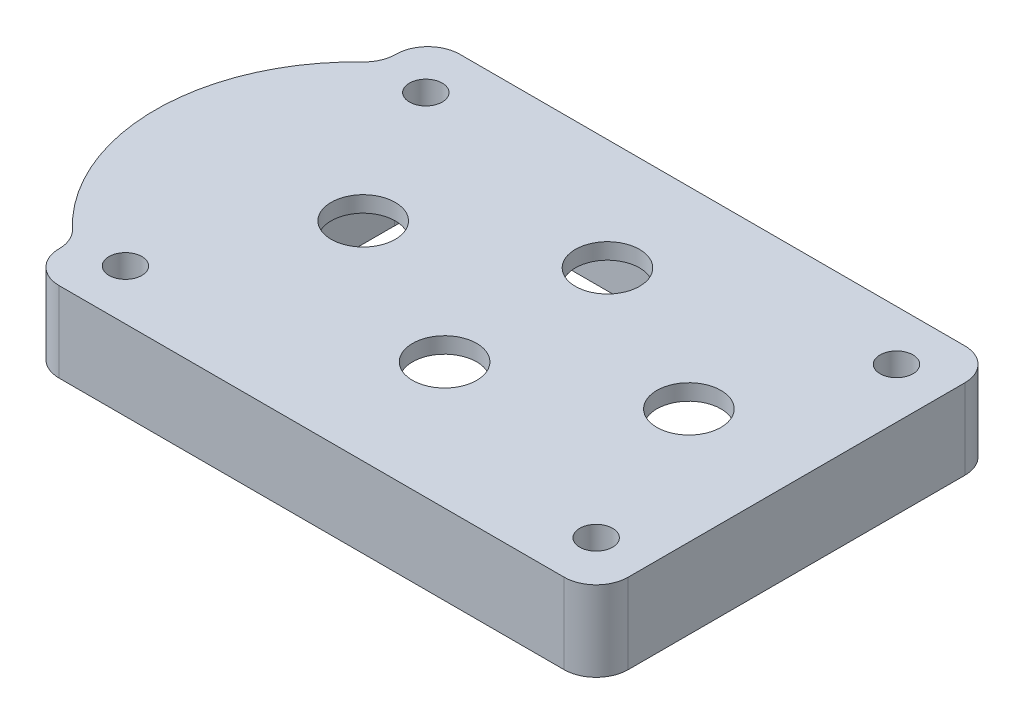
ISO-10303-21;
HEADER;
FILE_DESCRIPTION(('STEP AP214'),'2;1');
FILE_NAME('part.step','',(''),(''),'','','');
FILE_SCHEMA(('AUTOMOTIVE_DESIGN { 1 0 10303 214 1 1 1 1 }'));
ENDSEC;
DATA;
#1=APPLICATION_CONTEXT('core data for automotive mechanical design processes');
#2=APPLICATION_PROTOCOL_DEFINITION('international standard','automotive_design',2000,#1);
#3=PRODUCT_CONTEXT('',#1,'mechanical');
#4=PRODUCT('Part','Part','',(#3));
#5=PRODUCT_RELATED_PRODUCT_CATEGORY('part','',(#4));
#6=PRODUCT_DEFINITION_FORMATION('','',#4);
#7=PRODUCT_DEFINITION_CONTEXT('part definition',#1,'design');
#8=PRODUCT_DEFINITION('design','',#6,#7);
#9=PRODUCT_DEFINITION_SHAPE('','',#8);
#10=(LENGTH_UNIT() NAMED_UNIT(*) SI_UNIT(.MILLI.,.METRE.));
#11=(NAMED_UNIT(*) PLANE_ANGLE_UNIT() SI_UNIT($,.RADIAN.));
#12=(NAMED_UNIT(*) SI_UNIT($,.STERADIAN.) SOLID_ANGLE_UNIT());
#13=UNCERTAINTY_MEASURE_WITH_UNIT(LENGTH_MEASURE(1.E-05),#10,'distance_accuracy_value','');
#14=(GEOMETRIC_REPRESENTATION_CONTEXT(3) GLOBAL_UNCERTAINTY_ASSIGNED_CONTEXT((#13)) GLOBAL_UNIT_ASSIGNED_CONTEXT((#10,
#11,#12)) REPRESENTATION_CONTEXT('',''));
#15=CARTESIAN_POINT('',(0.,0.,0.));
#16=DIRECTION('',(0.,0.,1.));
#17=DIRECTION('',(1.,0.,0.));
#18=AXIS2_PLACEMENT_3D('',#15,#16,#17);
#19=CARTESIAN_POINT('',(2.64070335208821,5.,-5.56500000000103));
#20=DIRECTION('',(0.,-1.,0.));
#21=DIRECTION('',(0.,0.,-1.));
#22=AXIS2_PLACEMENT_3D('',#19,#20,#21);
#23=CYLINDRICAL_SURFACE('',#22,2.);
#24=CARTESIAN_POINT('',(2.64070335208821,5.,-5.56500000000103));
#25=DIRECTION('',(0.,-1.,0.));
#26=DIRECTION('',(0.,0.,-1.));
#27=AXIS2_PLACEMENT_3D('',#24,#25,#26);
#28=CIRCLE('',#27,2.);
#29=CARTESIAN_POINT('',(2.64070335208821,5.,-7.56500000000103));
#30=VERTEX_POINT('',#29);
#31=EDGE_CURVE('E246',#30,#30,#28,.T.);
#32=ORIENTED_EDGE('',*,*,#31,.F.);
#33=EDGE_LOOP('',(#32));
#34=FACE_BOUND('',#33,.T.);
#35=CARTESIAN_POINT('',(2.64070335208821,4.,-5.56500000000103));
#36=DIRECTION('',(0.,-1.,0.));
#37=DIRECTION('',(0.,0.,-1.));
#38=AXIS2_PLACEMENT_3D('',#35,#36,#37);
#39=CIRCLE('',#38,2.);
#40=CARTESIAN_POINT('',(2.64070335208821,4.,-7.56500000000103));
#41=VERTEX_POINT('',#40);
#42=EDGE_CURVE('E243',#41,#41,#39,.F.);
#43=ORIENTED_EDGE('',*,*,#42,.F.);
#44=EDGE_LOOP('',(#43));
#45=FACE_BOUND('',#44,.T.);
#46=ADVANCED_FACE('F40',(#34,#45),#23,.F.);
#47=CARTESIAN_POINT('',(12.8007033520882,5.,-0.485000000001033));
#48=DIRECTION('',(0.,-1.,0.));
#49=DIRECTION('',(0.,0.,-1.));
#50=AXIS2_PLACEMENT_3D('',#47,#48,#49);
#51=CYLINDRICAL_SURFACE('',#50,2.);
#52=CARTESIAN_POINT('',(12.8007033520882,5.,-0.485000000001033));
#53=DIRECTION('',(0.,-1.,0.));
#54=DIRECTION('',(0.,0.,-1.));
#55=AXIS2_PLACEMENT_3D('',#52,#53,#54);
#56=CIRCLE('',#55,2.);
#57=CARTESIAN_POINT('',(12.8007033520882,5.,-2.48500000000103));
#58=VERTEX_POINT('',#57);
#59=EDGE_CURVE('E254',#58,#58,#56,.T.);
#60=ORIENTED_EDGE('',*,*,#59,.F.);
#61=EDGE_LOOP('',(#60));
#62=FACE_BOUND('',#61,.T.);
#63=CARTESIAN_POINT('',(12.8007033520882,4.,-0.485000000001033));
#64=DIRECTION('',(0.,-1.,0.));
#65=DIRECTION('',(0.,0.,-1.));
#66=AXIS2_PLACEMENT_3D('',#63,#64,#65);
#67=CIRCLE('',#66,2.);
#68=CARTESIAN_POINT('',(12.8007033520882,4.,-2.48500000000103));
#69=VERTEX_POINT('',#68);
#70=EDGE_CURVE('E240',#69,#69,#67,.F.);
#71=ORIENTED_EDGE('',*,*,#70,.F.);
#72=EDGE_LOOP('',(#71));
#73=FACE_BOUND('',#72,.T.);
#74=ADVANCED_FACE('F412',(#62,#73),#51,.F.);
#75=CARTESIAN_POINT('',(2.64070335208821,5.,4.59499999999896));
#76=DIRECTION('',(0.,-1.,0.));
#77=DIRECTION('',(0.,0.,-1.));
#78=AXIS2_PLACEMENT_3D('',#75,#76,#77);
#79=CYLINDRICAL_SURFACE('',#78,2.);
#80=CARTESIAN_POINT('',(2.64070335208821,5.,4.59499999999896));
#81=DIRECTION('',(0.,-1.,0.));
#82=DIRECTION('',(0.,0.,-1.));
#83=AXIS2_PLACEMENT_3D('',#80,#81,#82);
#84=CIRCLE('',#83,2.);
#85=CARTESIAN_POINT('',(2.64070335208821,5.,2.59499999999896));
#86=VERTEX_POINT('',#85);
#87=EDGE_CURVE('E251',#86,#86,#84,.F.);
#88=ORIENTED_EDGE('',*,*,#87,.T.);
#89=EDGE_LOOP('',(#88));
#90=FACE_BOUND('',#89,.T.);
#91=CARTESIAN_POINT('',(2.64070335208821,4.,4.59499999999896));
#92=DIRECTION('',(0.,-1.,0.));
#93=DIRECTION('',(0.,0.,-1.));
#94=AXIS2_PLACEMENT_3D('',#91,#92,#93);
#95=CIRCLE('',#94,2.);
#96=CARTESIAN_POINT('',(2.64070335208821,4.,2.59499999999896));
#97=VERTEX_POINT('',#96);
#98=EDGE_CURVE('E237',#97,#97,#95,.T.);
#99=ORIENTED_EDGE('',*,*,#98,.T.);
#100=EDGE_LOOP('',(#99));
#101=FACE_BOUND('',#100,.T.);
#102=ADVANCED_FACE('F417',(#90,#101),#79,.F.);
#103=CARTESIAN_POINT('',(-7.51929664791179,5.,-0.485000000001034));
#104=DIRECTION('',(0.,-1.,0.));
#105=DIRECTION('',(0.,0.,-1.));
#106=AXIS2_PLACEMENT_3D('',#103,#104,#105);
#107=CYLINDRICAL_SURFACE('',#106,2.);
#108=CARTESIAN_POINT('',(-7.51929664791179,5.,-0.485000000001034));
#109=DIRECTION('',(0.,-1.,0.));
#110=DIRECTION('',(0.,0.,-1.));
#111=AXIS2_PLACEMENT_3D('',#108,#109,#110);
#112=CIRCLE('',#111,2.);
#113=CARTESIAN_POINT('',(-7.51929664791179,5.,-2.48500000000103));
#114=VERTEX_POINT('',#113);
#115=EDGE_CURVE('E247',#114,#114,#112,.F.);
#116=ORIENTED_EDGE('',*,*,#115,.T.);
#117=EDGE_LOOP('',(#116));
#118=FACE_BOUND('',#117,.T.);
#119=CARTESIAN_POINT('',(-7.51929664791179,4.,-0.485000000001034));
#120=DIRECTION('',(0.,-1.,0.));
#121=DIRECTION('',(0.,0.,-1.));
#122=AXIS2_PLACEMENT_3D('',#119,#120,#121);
#123=CIRCLE('',#122,2.);
#124=CARTESIAN_POINT('',(-7.51929664791179,4.,-2.48500000000103));
#125=VERTEX_POINT('',#124);
#126=EDGE_CURVE('E44',#125,#125,#123,.T.);
#127=ORIENTED_EDGE('',*,*,#126,.T.);
#128=EDGE_LOOP('',(#127));
#129=FACE_BOUND('',#128,.T.);
#130=ADVANCED_FACE('F407',(#118,#129),#107,.F.);
#131=CARTESIAN_POINT('',(0.,5.,0.));
#132=DIRECTION('',(0.,-1.,0.));
#133=DIRECTION('',(0.,0.,-1.));
#134=AXIS2_PLACEMENT_3D('',#131,#132,#133);
#135=PLANE('',#134);
#136=ORIENTED_EDGE('',*,*,#59,.T.);
#137=EDGE_LOOP('',(#136));
#138=FACE_BOUND('',#137,.T.);
#139=ORIENTED_EDGE('',*,*,#31,.T.);
#140=EDGE_LOOP('',(#139));
#141=FACE_BOUND('',#140,.T.);
#142=CARTESIAN_POINT('',(-12.4960015987213,5.,9.37));
#143=DIRECTION('',(0.,1.,0.));
#144=DIRECTION('',(0.,0.,1.));
#145=AXIS2_PLACEMENT_3D('',#142,#143,#144);
#146=CIRCLE('',#145,1.025);
#147=CARTESIAN_POINT('',(-12.4960015987213,5.,10.395));
#148=VERTEX_POINT('',#147);
#149=EDGE_CURVE('E269',#148,#148,#146,.T.);
#150=ORIENTED_EDGE('',*,*,#149,.F.);
#151=EDGE_LOOP('',(#150));
#152=FACE_BOUND('',#151,.T.);
#153=CARTESIAN_POINT('',(16.87,5.,-9.37));
#154=DIRECTION('',(0.,1.,0.));
#155=DIRECTION('',(0.,0.,1.));
#156=AXIS2_PLACEMENT_3D('',#153,#154,#155);
#157=CIRCLE('',#156,1.025);
#158=CARTESIAN_POINT('',(16.87,5.,-8.345));
#159=VERTEX_POINT('',#158);
#160=EDGE_CURVE('E262',#159,#159,#157,.T.);
#161=ORIENTED_EDGE('',*,*,#160,.F.);
#162=EDGE_LOOP('',(#161));
#163=FACE_BOUND('',#162,.T.);
#164=CARTESIAN_POINT('',(16.87,5.,9.37));
#165=DIRECTION('',(0.,1.,0.));
#166=DIRECTION('',(0.,0.,1.));
#167=AXIS2_PLACEMENT_3D('',#164,#165,#166);
#168=CIRCLE('',#167,1.025);
#169=CARTESIAN_POINT('',(16.87,5.,10.395));
#170=VERTEX_POINT('',#169);
#171=EDGE_CURVE('E250',#170,#170,#168,.T.);
#172=ORIENTED_EDGE('',*,*,#171,.F.);
#173=EDGE_LOOP('',(#172));
#174=FACE_BOUND('',#173,.T.);
#175=CARTESIAN_POINT('',(-12.4960015987213,5.,-9.37));
#176=DIRECTION('',(0.,1.,0.));
#177=DIRECTION('',(0.,0.,1.));
#178=AXIS2_PLACEMENT_3D('',#175,#176,#177);
#179=CIRCLE('',#178,1.025);
#180=CARTESIAN_POINT('',(-12.4960015987213,5.,-8.345));
#181=VERTEX_POINT('',#180);
#182=EDGE_CURVE('E268',#181,#181,#179,.T.);
#183=ORIENTED_EDGE('',*,*,#182,.F.);
#184=EDGE_LOOP('',(#183));
#185=FACE_BOUND('',#184,.T.);
#186=DIRECTION('',(-1.,0.,0.));
#187=VECTOR('',#186,1.);
#188=CARTESIAN_POINT('',(-20.,5.,-12.5));
#189=LINE('',#188,#187);
#190=CARTESIAN_POINT('',(18.,5.,-12.5));
#191=VERTEX_POINT('',#190);
#192=CARTESIAN_POINT('',(-13.5,5.,-12.5));
#193=VERTEX_POINT('',#192);
#194=EDGE_CURVE('E295',#191,#193,#189,.T.);
#195=ORIENTED_EDGE('',*,*,#194,.T.);
#196=CARTESIAN_POINT('',(-13.5,5.,-10.5));
#197=DIRECTION('',(0.,-1.,0.));
#198=DIRECTION('',(0.,0.,-1.));
#199=AXIS2_PLACEMENT_3D('',#196,#197,#198);
#200=CIRCLE('',#199,2.);
#201=CARTESIAN_POINT('',(-15.5,5.,-10.5));
#202=VERTEX_POINT('',#201);
#203=EDGE_CURVE('E326',#193,#202,#200,.F.);
#204=ORIENTED_EDGE('',*,*,#203,.T.);
#205=CARTESIAN_POINT('',(-17.5,5.,-10.5));
#206=DIRECTION('',(0.,-1.,0.));
#207=DIRECTION('',(0.,0.,-1.));
#208=AXIS2_PLACEMENT_3D('',#205,#206,#207);
#209=CIRCLE('',#208,2.);
#210=CARTESIAN_POINT('',(-16.1206896551724,5.,-9.05172413793104));
#211=VERTEX_POINT('',#210);
#212=EDGE_CURVE('E344',#202,#211,#209,.T.);
#213=ORIENTED_EDGE('',*,*,#212,.T.);
#214=CARTESIAN_POINT('',(-7.5,5.,0.));
#215=DIRECTION('',(0.,1.,0.));
#216=DIRECTION('',(0.,0.,1.));
#217=AXIS2_PLACEMENT_3D('',#214,#215,#216);
#218=CIRCLE('',#217,12.5);
#219=CARTESIAN_POINT('',(-16.1206896551724,5.,9.05172413793104));
#220=VERTEX_POINT('',#219);
#221=EDGE_CURVE('E287',#211,#220,#218,.T.);
#222=ORIENTED_EDGE('',*,*,#221,.T.);
#223=CARTESIAN_POINT('',(-17.5,5.,10.5));
#224=DIRECTION('',(0.,-1.,0.));
#225=DIRECTION('',(0.,0.,-1.));
#226=AXIS2_PLACEMENT_3D('',#223,#224,#225);
#227=CIRCLE('',#226,2.);
#228=CARTESIAN_POINT('',(-15.5,5.,10.5));
#229=VERTEX_POINT('',#228);
#230=EDGE_CURVE('E11',#220,#229,#227,.T.);
#231=ORIENTED_EDGE('',*,*,#230,.T.);
#232=CARTESIAN_POINT('',(-13.5,5.,10.5));
#233=DIRECTION('',(0.,-1.,0.));
#234=DIRECTION('',(0.,0.,-1.));
#235=AXIS2_PLACEMENT_3D('',#232,#233,#234);
#236=CIRCLE('',#235,2.);
#237=CARTESIAN_POINT('',(-13.5,5.,12.5));
#238=VERTEX_POINT('',#237);
#239=EDGE_CURVE('E324',#229,#238,#236,.F.);
#240=ORIENTED_EDGE('',*,*,#239,.T.);
#241=DIRECTION('',(1.,0.,0.));
#242=VECTOR('',#241,1.);
#243=CARTESIAN_POINT('',(-20.,5.,12.5));
#244=LINE('',#243,#242);
#245=CARTESIAN_POINT('',(18.,5.,12.5));
#246=VERTEX_POINT('',#245);
#247=EDGE_CURVE('E299',#238,#246,#244,.T.);
#248=ORIENTED_EDGE('',*,*,#247,.T.);
#249=CARTESIAN_POINT('',(18.,5.,10.5));
#250=DIRECTION('',(0.,-1.,0.));
#251=DIRECTION('',(0.,0.,-1.));
#252=AXIS2_PLACEMENT_3D('',#249,#250,#251);
#253=CIRCLE('',#252,2.);
#254=CARTESIAN_POINT('',(20.,5.,10.5));
#255=VERTEX_POINT('',#254);
#256=EDGE_CURVE('E322',#246,#255,#253,.F.);
#257=ORIENTED_EDGE('',*,*,#256,.T.);
#258=DIRECTION('',(0.,0.,-1.));
#259=VECTOR('',#258,1.);
#260=CARTESIAN_POINT('',(20.,5.,12.5));
#261=LINE('',#260,#259);
#262=CARTESIAN_POINT('',(20.,5.,-10.5));
#263=VERTEX_POINT('',#262);
#264=EDGE_CURVE('E291',#255,#263,#261,.T.);
#265=ORIENTED_EDGE('',*,*,#264,.T.);
#266=CARTESIAN_POINT('',(18.,5.,-10.5));
#267=DIRECTION('',(0.,-1.,0.));
#268=DIRECTION('',(0.,0.,-1.));
#269=AXIS2_PLACEMENT_3D('',#266,#267,#268);
#270=CIRCLE('',#269,2.);
#271=EDGE_CURVE('E320',#263,#191,#270,.F.);
#272=ORIENTED_EDGE('',*,*,#271,.T.);
#273=EDGE_LOOP('',(#195,#204,#213,#222,#231,#240,#248,#257,#265,#272));
#274=FACE_BOUND('',#273,.T.);
#275=ORIENTED_EDGE('',*,*,#87,.F.);
#276=EDGE_LOOP('',(#275));
#277=FACE_BOUND('',#276,.T.);
#278=ORIENTED_EDGE('',*,*,#115,.F.);
#279=EDGE_LOOP('',(#278));
#280=FACE_BOUND('',#279,.T.);
#281=ADVANCED_FACE('F361',(#138,#141,#152,#163,#174,#185,#274,#277,#280),#135,.F.);
#282=CARTESIAN_POINT('',(0.,0.,0.));
#283=DIRECTION('',(0.,-1.,0.));
#284=DIRECTION('',(0.,0.,-1.));
#285=AXIS2_PLACEMENT_3D('',#282,#283,#284);
#286=PLANE('',#285);
#287=CARTESIAN_POINT('',(-8.14429664791179,0.,5.21999999999896));
#288=DIRECTION('',(0.,-1.,0.));
#289=DIRECTION('',(0.,0.,-1.));
#290=AXIS2_PLACEMENT_3D('',#287,#288,#289);
#291=CIRCLE('',#290,3.125);
#292=CARTESIAN_POINT('',(-8.14429664791179,0.,8.34499999999897));
#293=VERTEX_POINT('',#292);
#294=CARTESIAN_POINT('',(-11.2692966479118,0.,5.21999999999896));
#295=VERTEX_POINT('',#294);
#296=EDGE_CURVE('E57',#293,#295,#291,.T.);
#297=ORIENTED_EDGE('',*,*,#296,.F.);
#298=DIRECTION('',(1.,0.,0.));
#299=VECTOR('',#298,1.);
#300=CARTESIAN_POINT('',(-8.14429664791179,0.,8.34499999999897));
#301=LINE('',#300,#299);
#302=CARTESIAN_POINT('',(13.4257033520882,0.,8.34499999999896));
#303=VERTEX_POINT('',#302);
#304=EDGE_CURVE('E188',#293,#303,#301,.T.);
#305=ORIENTED_EDGE('',*,*,#304,.T.);
#306=CARTESIAN_POINT('',(13.4257033520882,0.,5.21999999999896));
#307=DIRECTION('',(0.,-1.,0.));
#308=DIRECTION('',(0.,0.,-1.));
#309=AXIS2_PLACEMENT_3D('',#306,#307,#308);
#310=CIRCLE('',#309,3.125);
#311=CARTESIAN_POINT('',(16.5507033520882,0.,5.21999999999896));
#312=VERTEX_POINT('',#311);
#313=EDGE_CURVE('E191',#312,#303,#310,.T.);
#314=ORIENTED_EDGE('',*,*,#313,.F.);
#315=DIRECTION('',(0.,0.,1.));
#316=VECTOR('',#315,1.);
#317=CARTESIAN_POINT('',(16.5507033520882,0.,-6.19000000000103));
#318=LINE('',#317,#316);
#319=CARTESIAN_POINT('',(16.5507033520882,0.,-6.19000000000103));
#320=VERTEX_POINT('',#319);
#321=EDGE_CURVE('E219',#320,#312,#318,.T.);
#322=ORIENTED_EDGE('',*,*,#321,.F.);
#323=CARTESIAN_POINT('',(13.4257033520882,0.,-6.19000000000103));
#324=DIRECTION('',(0.,1.,0.));
#325=DIRECTION('',(0.,0.,1.));
#326=AXIS2_PLACEMENT_3D('',#323,#324,#325);
#327=CIRCLE('',#326,3.125);
#328=CARTESIAN_POINT('',(13.4257033520882,0.,-9.31500000000103));
#329=VERTEX_POINT('',#328);
#330=EDGE_CURVE('E216',#320,#329,#327,.T.);
#331=ORIENTED_EDGE('',*,*,#330,.T.);
#332=DIRECTION('',(1.,0.,0.));
#333=VECTOR('',#332,1.);
#334=CARTESIAN_POINT('',(-8.14429664791179,0.,-9.31500000000103));
#335=LINE('',#334,#333);
#336=CARTESIAN_POINT('',(-8.14429664791179,0.,-9.31500000000103));
#337=VERTEX_POINT('',#336);
#338=EDGE_CURVE('E213',#337,#329,#335,.T.);
#339=ORIENTED_EDGE('',*,*,#338,.F.);
#340=CARTESIAN_POINT('',(-8.14429664791179,0.,-6.19000000000103));
#341=DIRECTION('',(0.,1.,0.));
#342=DIRECTION('',(0.,0.,1.));
#343=AXIS2_PLACEMENT_3D('',#340,#341,#342);
#344=CIRCLE('',#343,3.125);
#345=CARTESIAN_POINT('',(-11.2692966479118,0.,-6.19000000000103));
#346=VERTEX_POINT('',#345);
#347=EDGE_CURVE('E210',#337,#346,#344,.T.);
#348=ORIENTED_EDGE('',*,*,#347,.T.);
#349=DIRECTION('',(0.,0.,1.));
#350=VECTOR('',#349,1.);
#351=CARTESIAN_POINT('',(-11.2692966479118,0.,-6.19000000000103));
#352=LINE('',#351,#350);
#353=EDGE_CURVE('E208',#346,#295,#352,.T.);
#354=ORIENTED_EDGE('',*,*,#353,.T.);
#355=EDGE_LOOP('',(#297,#305,#314,#322,#331,#339,#348,#354));
#356=FACE_BOUND('',#355,.T.);
#357=CARTESIAN_POINT('',(-12.4960015987213,0.,9.37));
#358=DIRECTION('',(0.,1.,0.));
#359=DIRECTION('',(0.,0.,1.));
#360=AXIS2_PLACEMENT_3D('',#357,#358,#359);
#361=CIRCLE('',#360,1.025);
#362=CARTESIAN_POINT('',(-12.4960015987213,0.,10.395));
#363=VERTEX_POINT('',#362);
#364=EDGE_CURVE('E265',#363,#363,#361,.T.);
#365=ORIENTED_EDGE('',*,*,#364,.T.);
#366=EDGE_LOOP('',(#365));
#367=FACE_BOUND('',#366,.T.);
#368=CARTESIAN_POINT('',(16.87,0.,-9.37));
#369=DIRECTION('',(0.,1.,0.));
#370=DIRECTION('',(0.,0.,1.));
#371=AXIS2_PLACEMENT_3D('',#368,#369,#370);
#372=CIRCLE('',#371,1.025);
#373=CARTESIAN_POINT('',(16.87,0.,-8.345));
#374=VERTEX_POINT('',#373);
#375=EDGE_CURVE('E272',#374,#374,#372,.T.);
#376=ORIENTED_EDGE('',*,*,#375,.T.);
#377=EDGE_LOOP('',(#376));
#378=FACE_BOUND('',#377,.T.);
#379=CARTESIAN_POINT('',(16.87,0.,9.37));
#380=DIRECTION('',(0.,1.,0.));
#381=DIRECTION('',(0.,0.,1.));
#382=AXIS2_PLACEMENT_3D('',#379,#380,#381);
#383=CIRCLE('',#382,1.025);
#384=CARTESIAN_POINT('',(16.87,0.,10.395));
#385=VERTEX_POINT('',#384);
#386=EDGE_CURVE('E259',#385,#385,#383,.T.);
#387=ORIENTED_EDGE('',*,*,#386,.T.);
#388=EDGE_LOOP('',(#387));
#389=FACE_BOUND('',#388,.T.);
#390=CARTESIAN_POINT('',(-12.4960015987213,0.,-9.37));
#391=DIRECTION('',(0.,1.,0.));
#392=DIRECTION('',(0.,0.,1.));
#393=AXIS2_PLACEMENT_3D('',#390,#391,#392);
#394=CIRCLE('',#393,1.025);
#395=CARTESIAN_POINT('',(-12.4960015987213,0.,-8.345));
#396=VERTEX_POINT('',#395);
#397=EDGE_CURVE('E277',#396,#396,#394,.T.);
#398=ORIENTED_EDGE('',*,*,#397,.T.);
#399=EDGE_LOOP('',(#398));
#400=FACE_BOUND('',#399,.T.);
#401=CARTESIAN_POINT('',(-7.5,0.,0.));
#402=DIRECTION('',(0.,1.,0.));
#403=DIRECTION('',(0.,0.,1.));
#404=AXIS2_PLACEMENT_3D('',#401,#402,#403);
#405=CIRCLE('',#404,12.5);
#406=CARTESIAN_POINT('',(-16.1206896551724,0.,-9.05172413793104));
#407=VERTEX_POINT('',#406);
#408=CARTESIAN_POINT('',(-16.1206896551724,0.,9.05172413793104));
#409=VERTEX_POINT('',#408);
#410=EDGE_CURVE('E283',#407,#409,#405,.T.);
#411=ORIENTED_EDGE('',*,*,#410,.F.);
#412=CARTESIAN_POINT('',(-17.5,0.,-10.5));
#413=DIRECTION('',(0.,-1.,0.));
#414=DIRECTION('',(0.,0.,-1.));
#415=AXIS2_PLACEMENT_3D('',#412,#413,#414);
#416=CIRCLE('',#415,2.);
#417=CARTESIAN_POINT('',(-15.5,0.,-10.5));
#418=VERTEX_POINT('',#417);
#419=EDGE_CURVE('E346',#407,#418,#416,.F.);
#420=ORIENTED_EDGE('',*,*,#419,.T.);
#421=CARTESIAN_POINT('',(-13.5,0.,-10.5));
#422=DIRECTION('',(0.,-1.,0.));
#423=DIRECTION('',(0.,0.,-1.));
#424=AXIS2_PLACEMENT_3D('',#421,#422,#423);
#425=CIRCLE('',#424,2.);
#426=CARTESIAN_POINT('',(-13.5,0.,-12.5));
#427=VERTEX_POINT('',#426);
#428=EDGE_CURVE('E333',#418,#427,#425,.T.);
#429=ORIENTED_EDGE('',*,*,#428,.T.);
#430=DIRECTION('',(-1.,0.,0.));
#431=VECTOR('',#430,1.);
#432=CARTESIAN_POINT('',(-20.,0.,-12.5));
#433=LINE('',#432,#431);
#434=CARTESIAN_POINT('',(18.,0.,-12.5));
#435=VERTEX_POINT('',#434);
#436=EDGE_CURVE('E305',#435,#427,#433,.T.);
#437=ORIENTED_EDGE('',*,*,#436,.F.);
#438=CARTESIAN_POINT('',(18.,0.,-10.5));
#439=DIRECTION('',(0.,-1.,0.));
#440=DIRECTION('',(0.,0.,-1.));
#441=AXIS2_PLACEMENT_3D('',#438,#439,#440);
#442=CIRCLE('',#441,2.);
#443=CARTESIAN_POINT('',(20.,0.,-10.5));
#444=VERTEX_POINT('',#443);
#445=EDGE_CURVE('E328',#435,#444,#442,.T.);
#446=ORIENTED_EDGE('',*,*,#445,.T.);
#447=DIRECTION('',(0.,0.,-1.));
#448=VECTOR('',#447,1.);
#449=CARTESIAN_POINT('',(20.,0.,12.5));
#450=LINE('',#449,#448);
#451=CARTESIAN_POINT('',(20.,0.,10.5));
#452=VERTEX_POINT('',#451);
#453=EDGE_CURVE('E286',#452,#444,#450,.T.);
#454=ORIENTED_EDGE('',*,*,#453,.F.);
#455=CARTESIAN_POINT('',(18.,0.,10.5));
#456=DIRECTION('',(0.,-1.,0.));
#457=DIRECTION('',(0.,0.,-1.));
#458=AXIS2_PLACEMENT_3D('',#455,#456,#457);
#459=CIRCLE('',#458,2.);
#460=CARTESIAN_POINT('',(18.,0.,12.5));
#461=VERTEX_POINT('',#460);
#462=EDGE_CURVE('E330',#452,#461,#459,.T.);
#463=ORIENTED_EDGE('',*,*,#462,.T.);
#464=DIRECTION('',(1.,0.,0.));
#465=VECTOR('',#464,1.);
#466=CARTESIAN_POINT('',(-20.,0.,12.5));
#467=LINE('',#466,#465);
#468=CARTESIAN_POINT('',(-13.5,0.,12.5));
#469=VERTEX_POINT('',#468);
#470=EDGE_CURVE('E296',#469,#461,#467,.T.);
#471=ORIENTED_EDGE('',*,*,#470,.F.);
#472=CARTESIAN_POINT('',(-13.5,0.,10.5));
#473=DIRECTION('',(0.,-1.,0.));
#474=DIRECTION('',(0.,0.,-1.));
#475=AXIS2_PLACEMENT_3D('',#472,#473,#474);
#476=CIRCLE('',#475,2.);
#477=CARTESIAN_POINT('',(-15.5,0.,10.5));
#478=VERTEX_POINT('',#477);
#479=EDGE_CURVE('E65',#469,#478,#476,.T.);
#480=ORIENTED_EDGE('',*,*,#479,.T.);
#481=CARTESIAN_POINT('',(-17.5,0.,10.5));
#482=DIRECTION('',(0.,-1.,0.));
#483=DIRECTION('',(0.,0.,-1.));
#484=AXIS2_PLACEMENT_3D('',#481,#482,#483);
#485=CIRCLE('',#484,2.);
#486=EDGE_CURVE('E49',#478,#409,#485,.F.);
#487=ORIENTED_EDGE('',*,*,#486,.T.);
#488=EDGE_LOOP('',(#411,#420,#429,#437,#446,#454,#463,#471,#480,#487));
#489=FACE_BOUND('',#488,.T.);
#490=ADVANCED_FACE('F396',(#356,#367,#378,#389,#400,#489),#286,.T.);
#491=CARTESIAN_POINT('',(-20.,5.,12.5));
#492=DIRECTION('',(0.,0.,-1.));
#493=DIRECTION('',(-1.,0.,0.));
#494=AXIS2_PLACEMENT_3D('',#491,#492,#493);
#495=PLANE('',#494);
#496=ORIENTED_EDGE('',*,*,#247,.F.);
#497=DIRECTION('',(0.,1.,0.));
#498=VECTOR('',#497,1.);
#499=CARTESIAN_POINT('',(-13.5,0.,12.5));
#500=LINE('',#499,#498);
#501=EDGE_CURVE('E337',#238,#469,#500,.F.);
#502=ORIENTED_EDGE('',*,*,#501,.T.);
#503=ORIENTED_EDGE('',*,*,#470,.T.);
#504=DIRECTION('',(0.,-1.,0.));
#505=VECTOR('',#504,1.);
#506=CARTESIAN_POINT('',(18.,5.,12.5));
#507=LINE('',#506,#505);
#508=EDGE_CURVE('E335',#461,#246,#507,.F.);
#509=ORIENTED_EDGE('',*,*,#508,.T.);
#510=EDGE_LOOP('',(#496,#502,#503,#509));
#511=FACE_BOUND('',#510,.T.);
#512=ADVANCED_FACE('F365',(#511),#495,.F.);
#513=CARTESIAN_POINT('',(20.,5.,12.5));
#514=DIRECTION('',(-1.,0.,0.));
#515=DIRECTION('',(0.,0.,1.));
#516=AXIS2_PLACEMENT_3D('',#513,#514,#515);
#517=PLANE('',#516);
#518=ORIENTED_EDGE('',*,*,#264,.F.);
#519=DIRECTION('',(0.,-1.,0.));
#520=VECTOR('',#519,1.);
#521=CARTESIAN_POINT('',(20.,5.,10.5));
#522=LINE('',#521,#520);
#523=EDGE_CURVE('E341',#255,#452,#522,.T.);
#524=ORIENTED_EDGE('',*,*,#523,.T.);
#525=ORIENTED_EDGE('',*,*,#453,.T.);
#526=DIRECTION('',(0.,-1.,0.));
#527=VECTOR('',#526,1.);
#528=CARTESIAN_POINT('',(20.,5.,-10.5));
#529=LINE('',#528,#527);
#530=EDGE_CURVE('E339',#444,#263,#529,.F.);
#531=ORIENTED_EDGE('',*,*,#530,.T.);
#532=EDGE_LOOP('',(#518,#524,#525,#531));
#533=FACE_BOUND('',#532,.T.);
#534=ADVANCED_FACE('F373',(#533),#517,.F.);
#535=CARTESIAN_POINT('',(-20.,5.,-12.5));
#536=DIRECTION('',(0.,0.,1.));
#537=DIRECTION('',(1.,0.,0.));
#538=AXIS2_PLACEMENT_3D('',#535,#536,#537);
#539=PLANE('',#538);
#540=ORIENTED_EDGE('',*,*,#436,.T.);
#541=DIRECTION('',(0.,1.,0.));
#542=VECTOR('',#541,1.);
#543=CARTESIAN_POINT('',(-13.5,5.,-12.5));
#544=LINE('',#543,#542);
#545=EDGE_CURVE('E318',#427,#193,#544,.T.);
#546=ORIENTED_EDGE('',*,*,#545,.T.);
#547=ORIENTED_EDGE('',*,*,#194,.F.);
#548=DIRECTION('',(0.,-1.,0.));
#549=VECTOR('',#548,1.);
#550=CARTESIAN_POINT('',(18.,5.,-12.5));
#551=LINE('',#550,#549);
#552=EDGE_CURVE('E315',#191,#435,#551,.T.);
#553=ORIENTED_EDGE('',*,*,#552,.T.);
#554=EDGE_LOOP('',(#540,#546,#547,#553));
#555=FACE_BOUND('',#554,.T.);
#556=ADVANCED_FACE('F381',(#555),#539,.F.);
#557=CARTESIAN_POINT('',(-7.5,0.,0.));
#558=DIRECTION('',(0.,1.,0.));
#559=DIRECTION('',(0.,0.,1.));
#560=AXIS2_PLACEMENT_3D('',#557,#558,#559);
#561=CYLINDRICAL_SURFACE('',#560,12.5);
#562=ORIENTED_EDGE('',*,*,#221,.F.);
#563=DIRECTION('',(0.,1.,0.));
#564=VECTOR('',#563,1.);
#565=CARTESIAN_POINT('',(-16.1206896551724,0.,-9.05172413793104));
#566=LINE('',#565,#564);
#567=EDGE_CURVE('E312',#211,#407,#566,.F.);
#568=ORIENTED_EDGE('',*,*,#567,.T.);
#569=ORIENTED_EDGE('',*,*,#410,.T.);
#570=DIRECTION('',(0.,1.,0.));
#571=VECTOR('',#570,1.);
#572=CARTESIAN_POINT('',(-16.1206896551724,0.,9.05172413793104));
#573=LINE('',#572,#571);
#574=EDGE_CURVE('E302',#409,#220,#573,.T.);
#575=ORIENTED_EDGE('',*,*,#574,.T.);
#576=EDGE_LOOP('',(#562,#568,#569,#575));
#577=FACE_BOUND('',#576,.T.);
#578=ADVANCED_FACE('F393',(#577),#561,.T.);
#579=CARTESIAN_POINT('',(-13.5,5.,-10.5));
#580=DIRECTION('',(0.,-1.,0.));
#581=DIRECTION('',(0.,0.,-1.));
#582=AXIS2_PLACEMENT_3D('',#579,#580,#581);
#583=CYLINDRICAL_SURFACE('',#582,2.);
#584=ORIENTED_EDGE('',*,*,#545,.F.);
#585=ORIENTED_EDGE('',*,*,#428,.F.);
#586=DIRECTION('',(0.,1.,0.));
#587=VECTOR('',#586,1.);
#588=CARTESIAN_POINT('',(-15.5,0.,-10.5));
#589=LINE('',#588,#587);
#590=EDGE_CURVE('E290',#202,#418,#589,.F.);
#591=ORIENTED_EDGE('',*,*,#590,.F.);
#592=ORIENTED_EDGE('',*,*,#203,.F.);
#593=EDGE_LOOP('',(#584,#585,#591,#592));
#594=FACE_BOUND('',#593,.T.);
#595=ADVANCED_FACE('F386',(#594),#583,.T.);
#596=CARTESIAN_POINT('',(-17.5,0.,-10.5));
#597=DIRECTION('',(0.,1.,0.));
#598=DIRECTION('',(0.,0.,1.));
#599=AXIS2_PLACEMENT_3D('',#596,#597,#598);
#600=CYLINDRICAL_SURFACE('',#599,2.);
#601=ORIENTED_EDGE('',*,*,#419,.F.);
#602=ORIENTED_EDGE('',*,*,#567,.F.);
#603=ORIENTED_EDGE('',*,*,#212,.F.);
#604=ORIENTED_EDGE('',*,*,#590,.T.);
#605=EDGE_LOOP('',(#601,#602,#603,#604));
#606=FACE_BOUND('',#605,.T.);
#607=ADVANCED_FACE('F395',(#606),#600,.F.);
#608=CARTESIAN_POINT('',(-13.5,0.,10.5));
#609=DIRECTION('',(0.,-1.,0.));
#610=DIRECTION('',(0.,0.,-1.));
#611=AXIS2_PLACEMENT_3D('',#608,#609,#610);
#612=CYLINDRICAL_SURFACE('',#611,2.);
#613=ORIENTED_EDGE('',*,*,#501,.F.);
#614=ORIENTED_EDGE('',*,*,#239,.F.);
#615=DIRECTION('',(0.,1.,0.));
#616=VECTOR('',#615,1.);
#617=CARTESIAN_POINT('',(-15.5,5.,10.5));
#618=LINE('',#617,#616);
#619=EDGE_CURVE('E280',#478,#229,#618,.T.);
#620=ORIENTED_EDGE('',*,*,#619,.F.);
#621=ORIENTED_EDGE('',*,*,#479,.F.);
#622=EDGE_LOOP('',(#613,#614,#620,#621));
#623=FACE_BOUND('',#622,.T.);
#624=ADVANCED_FACE('F358',(#623),#612,.T.);
#625=CARTESIAN_POINT('',(-17.5,0.,10.5));
#626=DIRECTION('',(0.,1.,0.));
#627=DIRECTION('',(0.,0.,1.));
#628=AXIS2_PLACEMENT_3D('',#625,#626,#627);
#629=CYLINDRICAL_SURFACE('',#628,2.);
#630=ORIENTED_EDGE('',*,*,#230,.F.);
#631=ORIENTED_EDGE('',*,*,#574,.F.);
#632=ORIENTED_EDGE('',*,*,#486,.F.);
#633=ORIENTED_EDGE('',*,*,#619,.T.);
#634=EDGE_LOOP('',(#630,#631,#632,#633));
#635=FACE_BOUND('',#634,.T.);
#636=ADVANCED_FACE('F353',(#635),#629,.F.);
#637=CARTESIAN_POINT('',(18.,5.,10.5));
#638=DIRECTION('',(0.,-1.,0.));
#639=DIRECTION('',(0.,0.,-1.));
#640=AXIS2_PLACEMENT_3D('',#637,#638,#639);
#641=CYLINDRICAL_SURFACE('',#640,2.);
#642=ORIENTED_EDGE('',*,*,#256,.F.);
#643=ORIENTED_EDGE('',*,*,#508,.F.);
#644=ORIENTED_EDGE('',*,*,#462,.F.);
#645=ORIENTED_EDGE('',*,*,#523,.F.);
#646=EDGE_LOOP('',(#642,#643,#644,#645));
#647=FACE_BOUND('',#646,.T.);
#648=ADVANCED_FACE('F368',(#647),#641,.T.);
#649=CARTESIAN_POINT('',(18.,5.,-10.5));
#650=DIRECTION('',(0.,-1.,0.));
#651=DIRECTION('',(0.,0.,-1.));
#652=AXIS2_PLACEMENT_3D('',#649,#650,#651);
#653=CYLINDRICAL_SURFACE('',#652,2.);
#654=ORIENTED_EDGE('',*,*,#271,.F.);
#655=ORIENTED_EDGE('',*,*,#530,.F.);
#656=ORIENTED_EDGE('',*,*,#445,.F.);
#657=ORIENTED_EDGE('',*,*,#552,.F.);
#658=EDGE_LOOP('',(#654,#655,#656,#657));
#659=FACE_BOUND('',#658,.T.);
#660=ADVANCED_FACE('F42',(#659),#653,.T.);
#661=CARTESIAN_POINT('',(-12.4960015987213,0.,-9.37));
#662=DIRECTION('',(0.,1.,0.));
#663=DIRECTION('',(0.,0.,1.));
#664=AXIS2_PLACEMENT_3D('',#661,#662,#663);
#665=CYLINDRICAL_SURFACE('',#664,1.025);
#666=ORIENTED_EDGE('',*,*,#397,.F.);
#667=EDGE_LOOP('',(#666));
#668=FACE_BOUND('',#667,.T.);
#669=ORIENTED_EDGE('',*,*,#182,.T.);
#670=EDGE_LOOP('',(#669));
#671=FACE_BOUND('',#670,.T.);
#672=ADVANCED_FACE('F428',(#668,#671),#665,.F.);
#673=CARTESIAN_POINT('',(16.87,0.,9.37));
#674=DIRECTION('',(0.,1.,0.));
#675=DIRECTION('',(0.,0.,1.));
#676=AXIS2_PLACEMENT_3D('',#673,#674,#675);
#677=CYLINDRICAL_SURFACE('',#676,1.025);
#678=ORIENTED_EDGE('',*,*,#386,.F.);
#679=EDGE_LOOP('',(#678));
#680=FACE_BOUND('',#679,.T.);
#681=ORIENTED_EDGE('',*,*,#171,.T.);
#682=EDGE_LOOP('',(#681));
#683=FACE_BOUND('',#682,.T.);
#684=ADVANCED_FACE('F424',(#680,#683),#677,.F.);
#685=CARTESIAN_POINT('',(16.87,0.,-9.37));
#686=DIRECTION('',(0.,1.,0.));
#687=DIRECTION('',(0.,0.,1.));
#688=AXIS2_PLACEMENT_3D('',#685,#686,#687);
#689=CYLINDRICAL_SURFACE('',#688,1.025);
#690=ORIENTED_EDGE('',*,*,#375,.F.);
#691=EDGE_LOOP('',(#690));
#692=FACE_BOUND('',#691,.T.);
#693=ORIENTED_EDGE('',*,*,#160,.T.);
#694=EDGE_LOOP('',(#693));
#695=FACE_BOUND('',#694,.T.);
#696=ADVANCED_FACE('F427',(#692,#695),#689,.F.);
#697=CARTESIAN_POINT('',(-12.4960015987213,0.,9.37));
#698=DIRECTION('',(0.,1.,0.));
#699=DIRECTION('',(0.,0.,1.));
#700=AXIS2_PLACEMENT_3D('',#697,#698,#699);
#701=CYLINDRICAL_SURFACE('',#700,1.025);
#702=ORIENTED_EDGE('',*,*,#364,.F.);
#703=EDGE_LOOP('',(#702));
#704=FACE_BOUND('',#703,.T.);
#705=ORIENTED_EDGE('',*,*,#149,.T.);
#706=EDGE_LOOP('',(#705));
#707=FACE_BOUND('',#706,.T.);
#708=ADVANCED_FACE('F430',(#704,#707),#701,.F.);
#709=CARTESIAN_POINT('',(-8.14429664791179,4.,5.21999999999896));
#710=DIRECTION('',(0.,-1.,0.));
#711=DIRECTION('',(0.,0.,-1.));
#712=AXIS2_PLACEMENT_3D('',#709,#710,#711);
#713=PLANE('',#712);
#714=ORIENTED_EDGE('',*,*,#98,.F.);
#715=EDGE_LOOP('',(#714));
#716=FACE_BOUND('',#715,.T.);
#717=ORIENTED_EDGE('',*,*,#126,.F.);
#718=EDGE_LOOP('',(#717));
#719=FACE_BOUND('',#718,.T.);
#720=CARTESIAN_POINT('',(-8.14429664791179,4.,5.21999999999896));
#721=DIRECTION('',(0.,-1.,0.));
#722=DIRECTION('',(0.,0.,-1.));
#723=AXIS2_PLACEMENT_3D('',#720,#721,#722);
#724=CIRCLE('',#723,3.125);
#725=CARTESIAN_POINT('',(-8.14429664791179,4.,8.34499999999897));
#726=VERTEX_POINT('',#725);
#727=CARTESIAN_POINT('',(-11.2692966479118,4.,5.21999999999896));
#728=VERTEX_POINT('',#727);
#729=EDGE_CURVE('E178',#726,#728,#724,.T.);
#730=ORIENTED_EDGE('',*,*,#729,.T.);
#731=DIRECTION('',(0.,0.,1.));
#732=VECTOR('',#731,1.);
#733=CARTESIAN_POINT('',(-11.2692966479118,4.,-6.19000000000103));
#734=LINE('',#733,#732);
#735=CARTESIAN_POINT('',(-11.2692966479118,4.,-6.19000000000103));
#736=VERTEX_POINT('',#735);
#737=EDGE_CURVE('E168',#736,#728,#734,.T.);
#738=ORIENTED_EDGE('',*,*,#737,.F.);
#739=CARTESIAN_POINT('',(-8.14429664791179,4.,-6.19000000000103));
#740=DIRECTION('',(0.,1.,0.));
#741=DIRECTION('',(0.,0.,1.));
#742=AXIS2_PLACEMENT_3D('',#739,#740,#741);
#743=CIRCLE('',#742,3.125);
#744=CARTESIAN_POINT('',(-8.14429664791179,4.,-9.31500000000103));
#745=VERTEX_POINT('',#744);
#746=EDGE_CURVE('E177',#745,#736,#743,.T.);
#747=ORIENTED_EDGE('',*,*,#746,.F.);
#748=DIRECTION('',(1.,0.,0.));
#749=VECTOR('',#748,1.);
#750=CARTESIAN_POINT('',(-8.14429664791179,4.,-9.31500000000103));
#751=LINE('',#750,#749);
#752=CARTESIAN_POINT('',(13.4257033520882,4.,-9.31500000000103));
#753=VERTEX_POINT('',#752);
#754=EDGE_CURVE('E195',#745,#753,#751,.T.);
#755=ORIENTED_EDGE('',*,*,#754,.T.);
#756=CARTESIAN_POINT('',(13.4257033520882,4.,-6.19000000000103));
#757=DIRECTION('',(0.,1.,0.));
#758=DIRECTION('',(0.,0.,1.));
#759=AXIS2_PLACEMENT_3D('',#756,#757,#758);
#760=CIRCLE('',#759,3.125);
#761=CARTESIAN_POINT('',(16.5507033520882,4.,-6.19000000000103));
#762=VERTEX_POINT('',#761);
#763=EDGE_CURVE('E199',#762,#753,#760,.T.);
#764=ORIENTED_EDGE('',*,*,#763,.F.);
#765=DIRECTION('',(0.,0.,1.));
#766=VECTOR('',#765,1.);
#767=CARTESIAN_POINT('',(16.5507033520882,4.,-6.19000000000103));
#768=LINE('',#767,#766);
#769=CARTESIAN_POINT('',(16.5507033520882,4.,5.21999999999896));
#770=VERTEX_POINT('',#769);
#771=EDGE_CURVE('E201',#762,#770,#768,.T.);
#772=ORIENTED_EDGE('',*,*,#771,.T.);
#773=CARTESIAN_POINT('',(13.4257033520882,4.,5.21999999999896));
#774=DIRECTION('',(0.,-1.,0.));
#775=DIRECTION('',(0.,0.,-1.));
#776=AXIS2_PLACEMENT_3D('',#773,#774,#775);
#777=CIRCLE('',#776,3.125);
#778=CARTESIAN_POINT('',(13.4257033520882,4.,8.34499999999896));
#779=VERTEX_POINT('',#778);
#780=EDGE_CURVE('E204',#770,#779,#777,.T.);
#781=ORIENTED_EDGE('',*,*,#780,.T.);
#782=DIRECTION('',(1.,0.,0.));
#783=VECTOR('',#782,1.);
#784=CARTESIAN_POINT('',(-8.14429664791179,4.,8.34499999999897));
#785=LINE('',#784,#783);
#786=EDGE_CURVE('E182',#726,#779,#785,.T.);
#787=ORIENTED_EDGE('',*,*,#786,.F.);
#788=EDGE_LOOP('',(#730,#738,#747,#755,#764,#772,#781,#787));
#789=FACE_BOUND('',#788,.T.);
#790=ORIENTED_EDGE('',*,*,#70,.T.);
#791=EDGE_LOOP('',(#790));
#792=FACE_BOUND('',#791,.T.);
#793=ORIENTED_EDGE('',*,*,#42,.T.);
#794=EDGE_LOOP('',(#793));
#795=FACE_BOUND('',#794,.T.);
#796=ADVANCED_FACE('F185',(#716,#719,#789,#792,#795),#713,.T.);
#797=CARTESIAN_POINT('',(-8.14429664791179,4.,5.21999999999896));
#798=DIRECTION('',(0.,-1.,0.));
#799=DIRECTION('',(0.,0.,-1.));
#800=AXIS2_PLACEMENT_3D('',#797,#798,#799);
#801=CYLINDRICAL_SURFACE('',#800,3.125);
#802=ORIENTED_EDGE('',*,*,#296,.T.);
#803=DIRECTION('',(0.,-1.,0.));
#804=VECTOR('',#803,1.);
#805=CARTESIAN_POINT('',(-11.2692966479118,4.,5.21999999999896));
#806=LINE('',#805,#804);
#807=EDGE_CURVE('E171',#728,#295,#806,.T.);
#808=ORIENTED_EDGE('',*,*,#807,.F.);
#809=ORIENTED_EDGE('',*,*,#729,.F.);
#810=DIRECTION('',(0.,-1.,0.));
#811=VECTOR('',#810,1.);
#812=CARTESIAN_POINT('',(-8.14429664791179,4.,8.34499999999897));
#813=LINE('',#812,#811);
#814=EDGE_CURVE('E224',#726,#293,#813,.T.);
#815=ORIENTED_EDGE('',*,*,#814,.T.);
#816=EDGE_LOOP('',(#802,#808,#809,#815));
#817=FACE_BOUND('',#816,.T.);
#818=ADVANCED_FACE('F181',(#817),#801,.F.);
#819=CARTESIAN_POINT('',(-8.14429664791179,4.,8.34499999999897));
#820=DIRECTION('',(0.,0.,-1.));
#821=DIRECTION('',(-1.,0.,0.));
#822=AXIS2_PLACEMENT_3D('',#819,#820,#821);
#823=PLANE('',#822);
#824=ORIENTED_EDGE('',*,*,#304,.F.);
#825=ORIENTED_EDGE('',*,*,#814,.F.);
#826=ORIENTED_EDGE('',*,*,#786,.T.);
#827=DIRECTION('',(0.,-1.,0.));
#828=VECTOR('',#827,1.);
#829=CARTESIAN_POINT('',(13.4257033520882,4.,8.34499999999896));
#830=LINE('',#829,#828);
#831=EDGE_CURVE('E226',#779,#303,#830,.T.);
#832=ORIENTED_EDGE('',*,*,#831,.T.);
#833=EDGE_LOOP('',(#824,#825,#826,#832));
#834=FACE_BOUND('',#833,.T.);
#835=ADVANCED_FACE('F532',(#834),#823,.T.);
#836=CARTESIAN_POINT('',(13.4257033520882,4.,5.21999999999896));
#837=DIRECTION('',(0.,-1.,0.));
#838=DIRECTION('',(0.,0.,-1.));
#839=AXIS2_PLACEMENT_3D('',#836,#837,#838);
#840=CYLINDRICAL_SURFACE('',#839,3.125);
#841=ORIENTED_EDGE('',*,*,#313,.T.);
#842=ORIENTED_EDGE('',*,*,#831,.F.);
#843=ORIENTED_EDGE('',*,*,#780,.F.);
#844=DIRECTION('',(0.,-1.,0.));
#845=VECTOR('',#844,1.);
#846=CARTESIAN_POINT('',(16.5507033520882,4.,5.21999999999896));
#847=LINE('',#846,#845);
#848=EDGE_CURVE('E228',#770,#312,#847,.T.);
#849=ORIENTED_EDGE('',*,*,#848,.T.);
#850=EDGE_LOOP('',(#841,#842,#843,#849));
#851=FACE_BOUND('',#850,.T.);
#852=ADVANCED_FACE('F540',(#851),#840,.F.);
#853=CARTESIAN_POINT('',(16.5507033520882,4.,-6.19000000000103));
#854=DIRECTION('',(1.,0.,0.));
#855=DIRECTION('',(0.,0.,-1.));
#856=AXIS2_PLACEMENT_3D('',#853,#854,#855);
#857=PLANE('',#856);
#858=ORIENTED_EDGE('',*,*,#321,.T.);
#859=ORIENTED_EDGE('',*,*,#848,.F.);
#860=ORIENTED_EDGE('',*,*,#771,.F.);
#861=DIRECTION('',(0.,-1.,0.));
#862=VECTOR('',#861,1.);
#863=CARTESIAN_POINT('',(16.5507033520882,4.,-6.19000000000103));
#864=LINE('',#863,#862);
#865=EDGE_CURVE('E230',#762,#320,#864,.T.);
#866=ORIENTED_EDGE('',*,*,#865,.T.);
#867=EDGE_LOOP('',(#858,#859,#860,#866));
#868=FACE_BOUND('',#867,.T.);
#869=ADVANCED_FACE('F548',(#868),#857,.F.);
#870=CARTESIAN_POINT('',(13.4257033520882,4.,-6.19000000000103));
#871=DIRECTION('',(0.,-1.,0.));
#872=DIRECTION('',(0.,0.,-1.));
#873=AXIS2_PLACEMENT_3D('',#870,#871,#872);
#874=CYLINDRICAL_SURFACE('',#873,3.125);
#875=ORIENTED_EDGE('',*,*,#330,.F.);
#876=ORIENTED_EDGE('',*,*,#865,.F.);
#877=ORIENTED_EDGE('',*,*,#763,.T.);
#878=DIRECTION('',(0.,-1.,0.));
#879=VECTOR('',#878,1.);
#880=CARTESIAN_POINT('',(13.4257033520882,4.,-9.31500000000103));
#881=LINE('',#880,#879);
#882=EDGE_CURVE('E232',#753,#329,#881,.T.);
#883=ORIENTED_EDGE('',*,*,#882,.T.);
#884=EDGE_LOOP('',(#875,#876,#877,#883));
#885=FACE_BOUND('',#884,.T.);
#886=ADVANCED_FACE('F557',(#885),#874,.F.);
#887=CARTESIAN_POINT('',(-8.14429664791179,4.,-9.31500000000103));
#888=DIRECTION('',(0.,0.,-1.));
#889=DIRECTION('',(-1.,0.,0.));
#890=AXIS2_PLACEMENT_3D('',#887,#888,#889);
#891=PLANE('',#890);
#892=ORIENTED_EDGE('',*,*,#338,.T.);
#893=ORIENTED_EDGE('',*,*,#882,.F.);
#894=ORIENTED_EDGE('',*,*,#754,.F.);
#895=DIRECTION('',(0.,-1.,0.));
#896=VECTOR('',#895,1.);
#897=CARTESIAN_POINT('',(-8.14429664791179,4.,-9.31500000000103));
#898=LINE('',#897,#896);
#899=EDGE_CURVE('E234',#745,#337,#898,.T.);
#900=ORIENTED_EDGE('',*,*,#899,.T.);
#901=EDGE_LOOP('',(#892,#893,#894,#900));
#902=FACE_BOUND('',#901,.T.);
#903=ADVANCED_FACE('F565',(#902),#891,.F.);
#904=CARTESIAN_POINT('',(-8.14429664791179,4.,-6.19000000000103));
#905=DIRECTION('',(0.,-1.,0.));
#906=DIRECTION('',(0.,0.,-1.));
#907=AXIS2_PLACEMENT_3D('',#904,#905,#906);
#908=CYLINDRICAL_SURFACE('',#907,3.125);
#909=ORIENTED_EDGE('',*,*,#347,.F.);
#910=ORIENTED_EDGE('',*,*,#899,.F.);
#911=ORIENTED_EDGE('',*,*,#746,.T.);
#912=DIRECTION('',(0.,-1.,0.));
#913=VECTOR('',#912,1.);
#914=CARTESIAN_POINT('',(-11.2692966479118,4.,-6.19000000000103));
#915=LINE('',#914,#913);
#916=EDGE_CURVE('E173',#736,#346,#915,.T.);
#917=ORIENTED_EDGE('',*,*,#916,.T.);
#918=EDGE_LOOP('',(#909,#910,#911,#917));
#919=FACE_BOUND('',#918,.T.);
#920=ADVANCED_FACE('F574',(#919),#908,.F.);
#921=CARTESIAN_POINT('',(-11.2692966479118,4.,-6.19000000000103));
#922=DIRECTION('',(1.,0.,0.));
#923=DIRECTION('',(0.,0.,-1.));
#924=AXIS2_PLACEMENT_3D('',#921,#922,#923);
#925=PLANE('',#924);
#926=ORIENTED_EDGE('',*,*,#353,.F.);
#927=ORIENTED_EDGE('',*,*,#916,.F.);
#928=ORIENTED_EDGE('',*,*,#737,.T.);
#929=ORIENTED_EDGE('',*,*,#807,.T.);
#930=EDGE_LOOP('',(#926,#927,#928,#929));
#931=FACE_BOUND('',#930,.T.);
#932=ADVANCED_FACE('F170',(#931),#925,.T.);
#933=CLOSED_SHELL('',(#46,#74,#102,#130,#281,#490,#512,#534,#556,#578,#595,#607,#624,#636,#648,
#660,#672,#684,#696,#708,#796,#818,#835,#852,#869,#886,#903,#920,#932));
#934=MANIFOLD_SOLID_BREP('B2',#933);
#935=ADVANCED_BREP_SHAPE_REPRESENTATION('',(#18,#934),#14);
#936=SHAPE_DEFINITION_REPRESENTATION(#9,#935);
ENDSEC;
END-ISO-10303-21;
